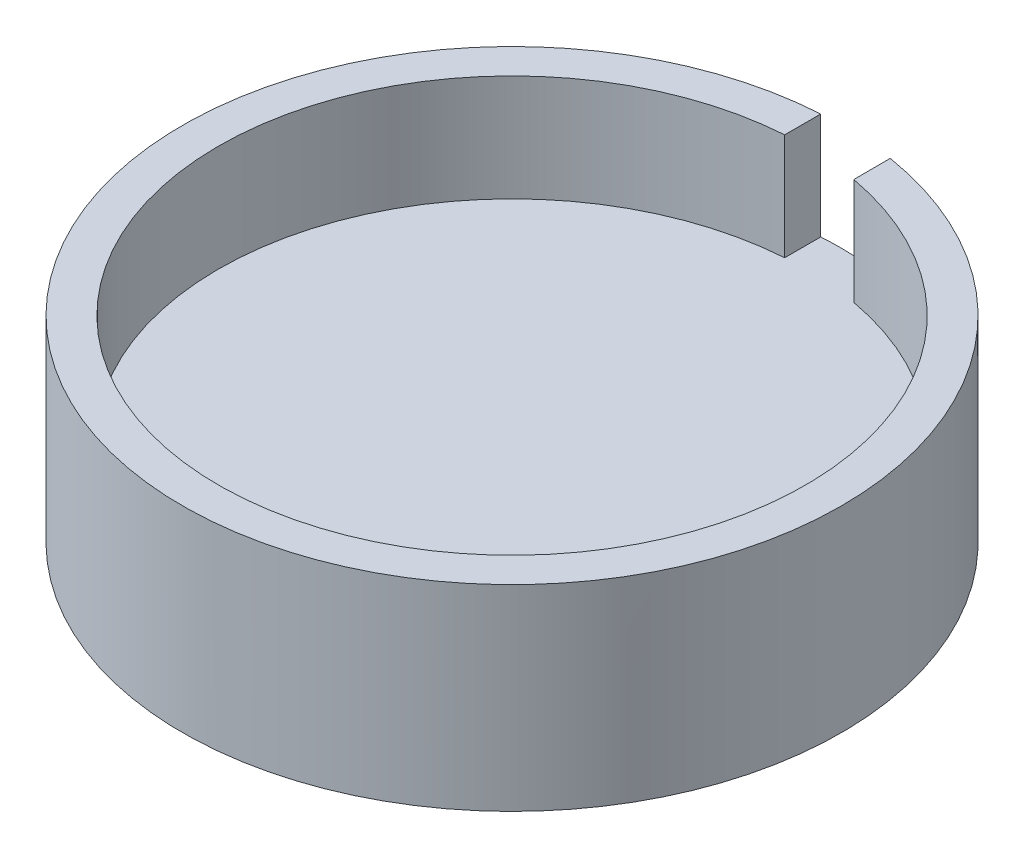
ISO-10303-21;
HEADER;
FILE_DESCRIPTION(('STEP AP214'),'2;1');
FILE_NAME('part.step','',(''),(''),'','','');
FILE_SCHEMA(('AUTOMOTIVE_DESIGN { 1 0 10303 214 1 1 1 1 }'));
ENDSEC;
DATA;
#1=APPLICATION_CONTEXT('core data for automotive mechanical design processes');
#2=APPLICATION_PROTOCOL_DEFINITION('international standard','automotive_design',2000,#1);
#3=PRODUCT_CONTEXT('',#1,'mechanical');
#4=PRODUCT('Part','Part','',(#3));
#5=PRODUCT_RELATED_PRODUCT_CATEGORY('part','',(#4));
#6=PRODUCT_DEFINITION_FORMATION('','',#4);
#7=PRODUCT_DEFINITION_CONTEXT('part definition',#1,'design');
#8=PRODUCT_DEFINITION('design','',#6,#7);
#9=PRODUCT_DEFINITION_SHAPE('','',#8);
#10=(LENGTH_UNIT() NAMED_UNIT(*) SI_UNIT(.MILLI.,.METRE.));
#11=(NAMED_UNIT(*) PLANE_ANGLE_UNIT() SI_UNIT($,.RADIAN.));
#12=(NAMED_UNIT(*) SI_UNIT($,.STERADIAN.) SOLID_ANGLE_UNIT());
#13=UNCERTAINTY_MEASURE_WITH_UNIT(LENGTH_MEASURE(1.E-05),#10,'distance_accuracy_value','');
#14=(GEOMETRIC_REPRESENTATION_CONTEXT(3) GLOBAL_UNCERTAINTY_ASSIGNED_CONTEXT((#13)) GLOBAL_UNIT_ASSIGNED_CONTEXT((#10,
#11,#12)) REPRESENTATION_CONTEXT('',''));
#15=CARTESIAN_POINT('',(0.,0.,0.));
#16=DIRECTION('',(0.,0.,1.));
#17=DIRECTION('',(1.,0.,0.));
#18=AXIS2_PLACEMENT_3D('',#15,#16,#17);
#19=CARTESIAN_POINT('',(0.,21.971,0.));
#20=DIRECTION('',(0.,-1.,0.));
#21=DIRECTION('',(0.,0.,-1.));
#22=AXIS2_PLACEMENT_3D('',#19,#20,#21);
#23=CYLINDRICAL_SURFACE('',#22,58.166);
#24=CARTESIAN_POINT('',(0.,3.175,0.));
#25=DIRECTION('',(0.,1.,0.));
#26=DIRECTION('',(0.,0.,1.));
#27=AXIS2_PLACEMENT_3D('',#24,#25,#26);
#28=CIRCLE('',#27,58.166);
#29=CARTESIAN_POINT('',(9.34075689132414,3.175,-57.4110948919909));
#30=VERTEX_POINT('',#29);
#31=CARTESIAN_POINT('',(-3.57037670971178,3.175,-58.0563171941758));
#32=VERTEX_POINT('',#31);
#33=EDGE_CURVE('E86',#30,#32,#28,.T.);
#34=ORIENTED_EDGE('',*,*,#33,.F.);
#35=DIRECTION('',(0.,1.,0.));
#36=VECTOR('',#35,1.);
#37=CARTESIAN_POINT('',(9.34075689132414,3.175,-57.4110948919909));
#38=LINE('',#37,#36);
#39=CARTESIAN_POINT('',(9.34075689132414,21.971,-57.4110948919909));
#40=VERTEX_POINT('',#39);
#41=EDGE_CURVE('E60',#30,#40,#38,.T.);
#42=ORIENTED_EDGE('',*,*,#41,.T.);
#43=CARTESIAN_POINT('',(0.,21.971,0.));
#44=DIRECTION('',(0.,1.,0.));
#45=DIRECTION('',(0.,0.,1.));
#46=AXIS2_PLACEMENT_3D('',#43,#44,#45);
#47=CIRCLE('',#46,58.166);
#48=CARTESIAN_POINT('',(-3.57037670971178,21.971,-58.0563171941758));
#49=VERTEX_POINT('',#48);
#50=EDGE_CURVE('E11',#49,#40,#47,.T.);
#51=ORIENTED_EDGE('',*,*,#50,.F.);
#52=DIRECTION('',(0.,1.,0.));
#53=VECTOR('',#52,1.);
#54=CARTESIAN_POINT('',(-3.57037670971178,3.175,-58.0563171941758));
#55=LINE('',#54,#53);
#56=EDGE_CURVE('E80',#32,#49,#55,.T.);
#57=ORIENTED_EDGE('',*,*,#56,.F.);
#58=EDGE_LOOP('',(#34,#42,#51,#57));
#59=FACE_BOUND('',#58,.T.);
#60=CARTESIAN_POINT('',(0.,-12.7,0.));
#61=DIRECTION('',(0.,-1.,0.));
#62=DIRECTION('',(0.,0.,-1.));
#63=AXIS2_PLACEMENT_3D('',#60,#61,#62);
#64=CIRCLE('',#63,58.166);
#65=CARTESIAN_POINT('',(0.,-12.7,-58.166));
#66=VERTEX_POINT('',#65);
#67=EDGE_CURVE('E109',#66,#66,#64,.T.);
#68=ORIENTED_EDGE('',*,*,#67,.F.);
#69=EDGE_LOOP('',(#68));
#70=FACE_BOUND('',#69,.T.);
#71=ADVANCED_FACE('F37',(#59,#70),#23,.T.);
#72=CARTESIAN_POINT('',(0.,21.971,0.));
#73=DIRECTION('',(0.,1.,0.));
#74=DIRECTION('',(0.,0.,1.));
#75=AXIS2_PLACEMENT_3D('',#72,#73,#74);
#76=PLANE('',#75);
#77=DIRECTION('',(-0.00345713476909509,0.,-0.999994024091738));
#78=VECTOR('',#77,1.);
#79=CARTESIAN_POINT('',(9.36304882857231,21.971,-50.9630373175871));
#80=LINE('',#79,#78);
#81=CARTESIAN_POINT('',(9.36304882857231,21.971,-50.9630373175871));
#82=VERTEX_POINT('',#81);
#83=EDGE_CURVE('E76',#82,#40,#80,.T.);
#84=ORIENTED_EDGE('',*,*,#83,.F.);
#85=CARTESIAN_POINT('',(0.,21.971,0.));
#86=DIRECTION('',(0.,1.,0.));
#87=DIRECTION('',(0.,0.,1.));
#88=AXIS2_PLACEMENT_3D('',#85,#86,#87);
#89=CIRCLE('',#88,51.816);
#90=CARTESIAN_POINT('',(-3.57037670971178,21.971,-51.6928454058272));
#91=VERTEX_POINT('',#90);
#92=EDGE_CURVE('E100',#91,#82,#89,.T.);
#93=ORIENTED_EDGE('',*,*,#92,.F.);
#94=DIRECTION('',(0.,0.,1.));
#95=VECTOR('',#94,1.);
#96=CARTESIAN_POINT('',(-3.57037670971178,21.971,-51.6928454058272));
#97=LINE('',#96,#95);
#98=EDGE_CURVE('E108',#49,#91,#97,.T.);
#99=ORIENTED_EDGE('',*,*,#98,.F.);
#100=ORIENTED_EDGE('',*,*,#50,.T.);
#101=EDGE_LOOP('',(#84,#93,#99,#100));
#102=FACE_BOUND('',#101,.T.);
#103=ADVANCED_FACE('F144',(#102),#76,.T.);
#104=CARTESIAN_POINT('',(0.,3.175,0.));
#105=DIRECTION('',(0.,1.,0.));
#106=DIRECTION('',(0.,0.,1.));
#107=AXIS2_PLACEMENT_3D('',#104,#105,#106);
#108=CYLINDRICAL_SURFACE('',#107,51.816);
#109=ORIENTED_EDGE('',*,*,#92,.T.);
#110=DIRECTION('',(0.,1.,0.));
#111=VECTOR('',#110,1.);
#112=CARTESIAN_POINT('',(9.36304882857231,3.175,-50.9630373175871));
#113=LINE('',#112,#111);
#114=CARTESIAN_POINT('',(9.36304882857231,3.175,-50.9630373175871));
#115=VERTEX_POINT('',#114);
#116=EDGE_CURVE('E95',#115,#82,#113,.T.);
#117=ORIENTED_EDGE('',*,*,#116,.F.);
#118=CARTESIAN_POINT('',(0.,3.175,0.));
#119=DIRECTION('',(0.,1.,0.));
#120=DIRECTION('',(0.,0.,1.));
#121=AXIS2_PLACEMENT_3D('',#118,#119,#120);
#122=CIRCLE('',#121,51.816);
#123=CARTESIAN_POINT('',(-3.57037670971178,3.175,-51.6928454058272));
#124=VERTEX_POINT('',#123);
#125=EDGE_CURVE('E44',#124,#115,#122,.T.);
#126=ORIENTED_EDGE('',*,*,#125,.F.);
#127=DIRECTION('',(0.,1.,0.));
#128=VECTOR('',#127,1.);
#129=CARTESIAN_POINT('',(-3.57037670971178,3.175,-51.6928454058272));
#130=LINE('',#129,#128);
#131=EDGE_CURVE('E83',#124,#91,#130,.T.);
#132=ORIENTED_EDGE('',*,*,#131,.T.);
#133=EDGE_LOOP('',(#109,#117,#126,#132));
#134=FACE_BOUND('',#133,.T.);
#135=ADVANCED_FACE('F148',(#134),#108,.F.);
#136=CARTESIAN_POINT('',(0.,3.175,0.));
#137=DIRECTION('',(0.,1.,0.));
#138=DIRECTION('',(0.,0.,1.));
#139=AXIS2_PLACEMENT_3D('',#136,#137,#138);
#140=PLANE('',#139);
#141=ORIENTED_EDGE('',*,*,#125,.T.);
#142=DIRECTION('',(-0.00345713476909509,0.,-0.999994024091738));
#143=VECTOR('',#142,1.);
#144=CARTESIAN_POINT('',(9.36304882857231,3.175,-50.9630373175871));
#145=LINE('',#144,#143);
#146=EDGE_CURVE('E85',#115,#30,#145,.T.);
#147=ORIENTED_EDGE('',*,*,#146,.T.);
#148=ORIENTED_EDGE('',*,*,#33,.T.);
#149=DIRECTION('',(0.,0.,1.));
#150=VECTOR('',#149,1.);
#151=CARTESIAN_POINT('',(-3.57037670971178,3.175,-51.6928454058272));
#152=LINE('',#151,#150);
#153=EDGE_CURVE('E51',#32,#124,#152,.T.);
#154=ORIENTED_EDGE('',*,*,#153,.T.);
#155=EDGE_LOOP('',(#141,#147,#148,#154));
#156=FACE_BOUND('',#155,.T.);
#157=ADVANCED_FACE('F89',(#156),#140,.T.);
#158=CARTESIAN_POINT('',(9.36304882857231,3.175,-50.9630373175871));
#159=DIRECTION('',(0.999994024091739,0.,-0.00345713476909509));
#160=DIRECTION('',(-0.00345713476909509,0.,-0.999994024091739));
#161=AXIS2_PLACEMENT_3D('',#158,#159,#160);
#162=PLANE('',#161);
#163=ORIENTED_EDGE('',*,*,#83,.T.);
#164=ORIENTED_EDGE('',*,*,#41,.F.);
#165=ORIENTED_EDGE('',*,*,#146,.F.);
#166=ORIENTED_EDGE('',*,*,#116,.T.);
#167=EDGE_LOOP('',(#163,#164,#165,#166));
#168=FACE_BOUND('',#167,.T.);
#169=ADVANCED_FACE('F157',(#168),#162,.F.);
#170=CARTESIAN_POINT('',(-3.57037670971178,3.175,-51.6928454058272));
#171=DIRECTION('',(-1.,0.,0.));
#172=DIRECTION('',(0.,0.,1.));
#173=AXIS2_PLACEMENT_3D('',#170,#171,#172);
#174=PLANE('',#173);
#175=ORIENTED_EDGE('',*,*,#98,.T.);
#176=ORIENTED_EDGE('',*,*,#131,.F.);
#177=ORIENTED_EDGE('',*,*,#153,.F.);
#178=ORIENTED_EDGE('',*,*,#56,.T.);
#179=EDGE_LOOP('',(#175,#176,#177,#178));
#180=FACE_BOUND('',#179,.T.);
#181=ADVANCED_FACE('F78',(#180),#174,.F.);
#182=CARTESIAN_POINT('',(0.,-12.7,0.));
#183=DIRECTION('',(0.,-1.,0.));
#184=DIRECTION('',(0.,0.,-1.));
#185=AXIS2_PLACEMENT_3D('',#182,#183,#184);
#186=PLANE('',#185);
#187=CARTESIAN_POINT('',(-29.083,-12.7,0.));
#188=DIRECTION('',(0.,-1.,0.));
#189=DIRECTION('',(0.,0.,-1.));
#190=AXIS2_PLACEMENT_3D('',#187,#188,#189);
#191=CIRCLE('',#190,6.477);
#192=CARTESIAN_POINT('',(-29.083,-12.7,-6.477));
#193=VERTEX_POINT('',#192);
#194=EDGE_CURVE('E120',#193,#193,#191,.T.);
#195=ORIENTED_EDGE('',*,*,#194,.F.);
#196=EDGE_LOOP('',(#195));
#197=FACE_BOUND('',#196,.T.);
#198=CARTESIAN_POINT('',(29.083,-12.7,0.));
#199=DIRECTION('',(0.,-1.,0.));
#200=DIRECTION('',(0.,0.,-1.));
#201=AXIS2_PLACEMENT_3D('',#198,#199,#200);
#202=CIRCLE('',#201,6.47699999999999);
#203=CARTESIAN_POINT('',(29.083,-12.7,-6.47699999999999));
#204=VERTEX_POINT('',#203);
#205=EDGE_CURVE('E114',#204,#204,#202,.T.);
#206=ORIENTED_EDGE('',*,*,#205,.F.);
#207=EDGE_LOOP('',(#206));
#208=FACE_BOUND('',#207,.T.);
#209=ORIENTED_EDGE('',*,*,#67,.T.);
#210=EDGE_LOOP('',(#209));
#211=FACE_BOUND('',#210,.T.);
#212=ADVANCED_FACE('F135',(#197,#208,#211),#186,.T.);
#213=CARTESIAN_POINT('',(29.083,0.,0.));
#214=DIRECTION('',(0.,-1.,0.));
#215=DIRECTION('',(0.,0.,-1.));
#216=AXIS2_PLACEMENT_3D('',#213,#214,#215);
#217=CYLINDRICAL_SURFACE('',#216,6.47699999999999);
#218=CARTESIAN_POINT('',(29.083,0.,0.));
#219=DIRECTION('',(0.,-1.,0.));
#220=DIRECTION('',(0.,0.,-1.));
#221=AXIS2_PLACEMENT_3D('',#218,#219,#220);
#222=CIRCLE('',#221,6.47699999999999);
#223=CARTESIAN_POINT('',(29.083,0.,-6.47699999999999));
#224=VERTEX_POINT('',#223);
#225=EDGE_CURVE('E117',#224,#224,#222,.T.);
#226=ORIENTED_EDGE('',*,*,#225,.F.);
#227=EDGE_LOOP('',(#226));
#228=FACE_BOUND('',#227,.T.);
#229=ORIENTED_EDGE('',*,*,#205,.T.);
#230=EDGE_LOOP('',(#229));
#231=FACE_BOUND('',#230,.T.);
#232=ADVANCED_FACE('F138',(#228,#231),#217,.F.);
#233=CARTESIAN_POINT('',(29.083,0.,0.));
#234=DIRECTION('',(0.,-1.,0.));
#235=DIRECTION('',(0.,0.,-1.));
#236=AXIS2_PLACEMENT_3D('',#233,#234,#235);
#237=PLANE('',#236);
#238=ORIENTED_EDGE('',*,*,#225,.T.);
#239=EDGE_LOOP('',(#238));
#240=FACE_BOUND('',#239,.T.);
#241=ADVANCED_FACE('F131',(#240),#237,.T.);
#242=CARTESIAN_POINT('',(-29.083,0.,0.));
#243=DIRECTION('',(0.,-1.,0.));
#244=DIRECTION('',(0.,0.,-1.));
#245=AXIS2_PLACEMENT_3D('',#242,#243,#244);
#246=CYLINDRICAL_SURFACE('',#245,6.477);
#247=CARTESIAN_POINT('',(-29.083,0.,0.));
#248=DIRECTION('',(0.,-1.,0.));
#249=DIRECTION('',(0.,0.,-1.));
#250=AXIS2_PLACEMENT_3D('',#247,#248,#249);
#251=CIRCLE('',#250,6.477);
#252=CARTESIAN_POINT('',(-29.083,0.,-6.477));
#253=VERTEX_POINT('',#252);
#254=EDGE_CURVE('E113',#253,#253,#251,.T.);
#255=ORIENTED_EDGE('',*,*,#254,.F.);
#256=EDGE_LOOP('',(#255));
#257=FACE_BOUND('',#256,.T.);
#258=ORIENTED_EDGE('',*,*,#194,.T.);
#259=EDGE_LOOP('',(#258));
#260=FACE_BOUND('',#259,.T.);
#261=ADVANCED_FACE('F128',(#257,#260),#246,.F.);
#262=CARTESIAN_POINT('',(-29.083,0.,0.));
#263=DIRECTION('',(0.,-1.,0.));
#264=DIRECTION('',(0.,0.,-1.));
#265=AXIS2_PLACEMENT_3D('',#262,#263,#264);
#266=PLANE('',#265);
#267=ORIENTED_EDGE('',*,*,#254,.T.);
#268=EDGE_LOOP('',(#267));
#269=FACE_BOUND('',#268,.T.);
#270=ADVANCED_FACE('F126',(#269),#266,.T.);
#271=CLOSED_SHELL('',(#71,#103,#135,#157,#169,#181,#212,#232,#241,#261,#270));
#272=MANIFOLD_SOLID_BREP('B2',#271);
#273=ADVANCED_BREP_SHAPE_REPRESENTATION('',(#18,#272),#14);
#274=SHAPE_DEFINITION_REPRESENTATION(#9,#273);
ENDSEC;
END-ISO-10303-21;
